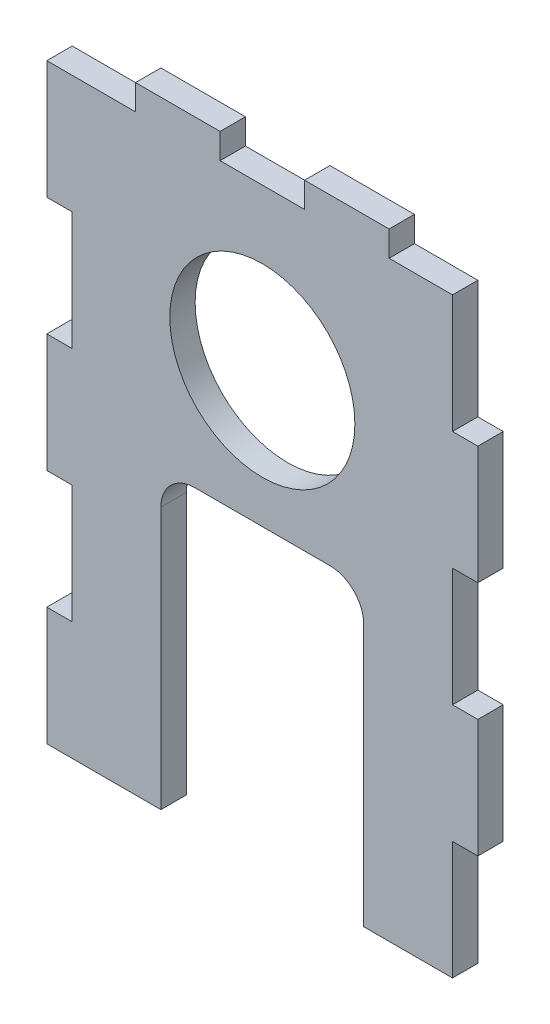
ISO-10303-21;
HEADER;
FILE_DESCRIPTION(('STEP AP214'),'2;1');
FILE_NAME('part.step','',(''),(''),'','','');
FILE_SCHEMA(('AUTOMOTIVE_DESIGN { 1 0 10303 214 1 1 1 1 }'));
ENDSEC;
DATA;
#1=APPLICATION_CONTEXT('core data for automotive mechanical design processes');
#2=APPLICATION_PROTOCOL_DEFINITION('international standard','automotive_design',2000,#1);
#3=PRODUCT_CONTEXT('',#1,'mechanical');
#4=PRODUCT('Part','Part','',(#3));
#5=PRODUCT_RELATED_PRODUCT_CATEGORY('part','',(#4));
#6=PRODUCT_DEFINITION_FORMATION('','',#4);
#7=PRODUCT_DEFINITION_CONTEXT('part definition',#1,'design');
#8=PRODUCT_DEFINITION('design','',#6,#7);
#9=PRODUCT_DEFINITION_SHAPE('','',#8);
#10=(LENGTH_UNIT() NAMED_UNIT(*) SI_UNIT(.MILLI.,.METRE.));
#11=(NAMED_UNIT(*) PLANE_ANGLE_UNIT() SI_UNIT($,.RADIAN.));
#12=(NAMED_UNIT(*) SI_UNIT($,.STERADIAN.) SOLID_ANGLE_UNIT());
#13=UNCERTAINTY_MEASURE_WITH_UNIT(LENGTH_MEASURE(1.E-05),#10,'distance_accuracy_value','');
#14=(GEOMETRIC_REPRESENTATION_CONTEXT(3) GLOBAL_UNCERTAINTY_ASSIGNED_CONTEXT((#13)) GLOBAL_UNIT_ASSIGNED_CONTEXT((#10,
#11,#12)) REPRESENTATION_CONTEXT('',''));
#15=CARTESIAN_POINT('',(0.,0.,0.));
#16=DIRECTION('',(0.,0.,1.));
#17=DIRECTION('',(1.,0.,0.));
#18=AXIS2_PLACEMENT_3D('',#15,#16,#17);
#19=CARTESIAN_POINT('',(22.5,-35.,3.));
#20=DIRECTION('',(-1.,0.,0.));
#21=DIRECTION('',(0.,0.,1.));
#22=AXIS2_PLACEMENT_3D('',#19,#20,#21);
#23=PLANE('',#22);
#24=DIRECTION('',(0.,1.,0.));
#25=VECTOR('',#24,1.);
#26=CARTESIAN_POINT('',(22.5,-35.,3.));
#27=LINE('',#26,#25);
#28=CARTESIAN_POINT('',(22.5,21.,3.));
#29=VERTEX_POINT('',#28);
#30=CARTESIAN_POINT('',(22.5,35.,3.));
#31=VERTEX_POINT('',#30);
#32=EDGE_CURVE('E36',#29,#31,#27,.T.);
#33=ORIENTED_EDGE('',*,*,#32,.F.);
#34=DIRECTION('',(0.,0.,-1.));
#35=VECTOR('',#34,1.);
#36=CARTESIAN_POINT('',(22.5,21.,17.3178210632764));
#37=LINE('',#36,#35);
#38=CARTESIAN_POINT('',(22.5,21.,0.));
#39=VERTEX_POINT('',#38);
#40=EDGE_CURVE('E279',#29,#39,#37,.T.);
#41=ORIENTED_EDGE('',*,*,#40,.T.);
#42=DIRECTION('',(0.,1.,0.));
#43=VECTOR('',#42,1.);
#44=CARTESIAN_POINT('',(22.5,-35.,0.));
#45=LINE('',#44,#43);
#46=CARTESIAN_POINT('',(22.5,35.,0.));
#47=VERTEX_POINT('',#46);
#48=EDGE_CURVE('E372',#39,#47,#45,.T.);
#49=ORIENTED_EDGE('',*,*,#48,.T.);
#50=DIRECTION('',(0.,0.,-1.));
#51=VECTOR('',#50,1.);
#52=CARTESIAN_POINT('',(22.5,35.,3.));
#53=LINE('',#52,#51);
#54=EDGE_CURVE('E351',#31,#47,#53,.T.);
#55=ORIENTED_EDGE('',*,*,#54,.F.);
#56=EDGE_LOOP('',(#33,#41,#49,#55));
#57=FACE_BOUND('',#56,.T.);
#58=ADVANCED_FACE('F32',(#57),#23,.F.);
#59=DIRECTION('',(0.,0.,-1.));
#60=VECTOR('',#59,1.);
#61=CARTESIAN_POINT('',(22.5,-21.,17.3178210632764));
#62=LINE('',#61,#60);
#63=CARTESIAN_POINT('',(22.5,-21.,3.));
#64=VERTEX_POINT('',#63);
#65=CARTESIAN_POINT('',(22.5,-21.,0.));
#66=VERTEX_POINT('',#65);
#67=EDGE_CURVE('E324',#64,#66,#62,.T.);
#68=ORIENTED_EDGE('',*,*,#67,.F.);
#69=CARTESIAN_POINT('',(22.5,-35.,3.));
#70=VERTEX_POINT('',#69);
#71=EDGE_CURVE('E404',#70,#64,#27,.T.);
#72=ORIENTED_EDGE('',*,*,#71,.F.);
#73=DIRECTION('',(0.,0.,-1.));
#74=VECTOR('',#73,1.);
#75=CARTESIAN_POINT('',(22.5,-35.,3.));
#76=LINE('',#75,#74);
#77=CARTESIAN_POINT('',(22.5,-35.,0.));
#78=VERTEX_POINT('',#77);
#79=EDGE_CURVE('E517',#70,#78,#76,.T.);
#80=ORIENTED_EDGE('',*,*,#79,.T.);
#81=EDGE_CURVE('E363',#78,#66,#45,.T.);
#82=ORIENTED_EDGE('',*,*,#81,.T.);
#83=EDGE_LOOP('',(#68,#72,#80,#82));
#84=FACE_BOUND('',#83,.T.);
#85=ADVANCED_FACE('F593',(#84),#23,.F.);
#86=CARTESIAN_POINT('',(-22.5,-35.,3.));
#87=DIRECTION('',(-1.,0.,0.));
#88=DIRECTION('',(0.,0.,1.));
#89=AXIS2_PLACEMENT_3D('',#86,#87,#88);
#90=PLANE('',#89);
#91=DIRECTION('',(0.,0.,-1.));
#92=VECTOR('',#91,1.);
#93=CARTESIAN_POINT('',(-22.5,-21.,17.3178210632764));
#94=LINE('',#93,#92);
#95=CARTESIAN_POINT('',(-22.5,-21.,3.));
#96=VERTEX_POINT('',#95);
#97=CARTESIAN_POINT('',(-22.5,-21.,0.));
#98=VERTEX_POINT('',#97);
#99=EDGE_CURVE('E300',#96,#98,#94,.T.);
#100=ORIENTED_EDGE('',*,*,#99,.F.);
#101=DIRECTION('',(0.,1.,0.));
#102=VECTOR('',#101,1.);
#103=CARTESIAN_POINT('',(-22.5,-35.,3.));
#104=LINE('',#103,#102);
#105=CARTESIAN_POINT('',(-22.5,-7.00000000000001,3.));
#106=VERTEX_POINT('',#105);
#107=EDGE_CURVE('E344',#96,#106,#104,.T.);
#108=ORIENTED_EDGE('',*,*,#107,.T.);
#109=DIRECTION('',(0.,0.,-1.));
#110=VECTOR('',#109,1.);
#111=CARTESIAN_POINT('',(-22.5,-7.00000000000001,17.3178210632764));
#112=LINE('',#111,#110);
#113=CARTESIAN_POINT('',(-22.5,-7.00000000000001,0.));
#114=VERTEX_POINT('',#113);
#115=EDGE_CURVE('E529',#106,#114,#112,.T.);
#116=ORIENTED_EDGE('',*,*,#115,.T.);
#117=DIRECTION('',(0.,1.,0.));
#118=VECTOR('',#117,1.);
#119=CARTESIAN_POINT('',(-22.5,-35.,0.));
#120=LINE('',#119,#118);
#121=EDGE_CURVE('E339',#98,#114,#120,.T.);
#122=ORIENTED_EDGE('',*,*,#121,.F.);
#123=EDGE_LOOP('',(#100,#108,#116,#122));
#124=FACE_BOUND('',#123,.T.);
#125=ADVANCED_FACE('F526',(#124),#90,.T.);
#126=DIRECTION('',(0.,0.,-1.));
#127=VECTOR('',#126,1.);
#128=CARTESIAN_POINT('',(-22.5,6.99999999999999,17.3178210632764));
#129=LINE('',#128,#127);
#130=CARTESIAN_POINT('',(-22.5,6.99999999999999,3.));
#131=VERTEX_POINT('',#130);
#132=CARTESIAN_POINT('',(-22.5,6.99999999999999,0.));
#133=VERTEX_POINT('',#132);
#134=EDGE_CURVE('E409',#131,#133,#129,.T.);
#135=ORIENTED_EDGE('',*,*,#134,.F.);
#136=CARTESIAN_POINT('',(-22.5,21.,3.));
#137=VERTEX_POINT('',#136);
#138=EDGE_CURVE('E360',#131,#137,#104,.T.);
#139=ORIENTED_EDGE('',*,*,#138,.T.);
#140=DIRECTION('',(0.,0.,-1.));
#141=VECTOR('',#140,1.);
#142=CARTESIAN_POINT('',(-22.5,21.,17.3178210632764));
#143=LINE('',#142,#141);
#144=CARTESIAN_POINT('',(-22.5,21.,0.));
#145=VERTEX_POINT('',#144);
#146=EDGE_CURVE('E412',#137,#145,#143,.T.);
#147=ORIENTED_EDGE('',*,*,#146,.T.);
#148=EDGE_CURVE('E343',#133,#145,#120,.T.);
#149=ORIENTED_EDGE('',*,*,#148,.F.);
#150=EDGE_LOOP('',(#135,#139,#147,#149));
#151=FACE_BOUND('',#150,.T.);
#152=ADVANCED_FACE('F572',(#151),#90,.T.);
#153=CARTESIAN_POINT('',(-22.5,35.,3.));
#154=DIRECTION('',(0.,1.,0.));
#155=DIRECTION('',(0.,0.,1.));
#156=AXIS2_PLACEMENT_3D('',#153,#154,#155);
#157=PLANE('',#156);
#158=DIRECTION('',(0.,0.,1.));
#159=VECTOR('',#158,1.);
#160=CARTESIAN_POINT('',(5.,35.,-10.4403065089106));
#161=LINE('',#160,#159);
#162=CARTESIAN_POINT('',(5.,35.,0.));
#163=VERTEX_POINT('',#162);
#164=CARTESIAN_POINT('',(5.,35.,3.));
#165=VERTEX_POINT('',#164);
#166=EDGE_CURVE('E426',#163,#165,#161,.T.);
#167=ORIENTED_EDGE('',*,*,#166,.F.);
#168=DIRECTION('',(1.,0.,0.));
#169=VECTOR('',#168,1.);
#170=CARTESIAN_POINT('',(-22.5,35.,0.));
#171=LINE('',#170,#169);
#172=CARTESIAN_POINT('',(-5.00000000000002,35.,0.));
#173=VERTEX_POINT('',#172);
#174=EDGE_CURVE('E388',#173,#163,#171,.T.);
#175=ORIENTED_EDGE('',*,*,#174,.F.);
#176=DIRECTION('',(0.,0.,1.));
#177=VECTOR('',#176,1.);
#178=CARTESIAN_POINT('',(-5.,35.,-10.4403065089106));
#179=LINE('',#178,#177);
#180=CARTESIAN_POINT('',(-5.00000000000002,35.,3.));
#181=VERTEX_POINT('',#180);
#182=EDGE_CURVE('E460',#173,#181,#179,.T.);
#183=ORIENTED_EDGE('',*,*,#182,.T.);
#184=DIRECTION('',(1.,0.,0.));
#185=VECTOR('',#184,1.);
#186=CARTESIAN_POINT('',(-22.5,35.,3.));
#187=LINE('',#186,#185);
#188=EDGE_CURVE('E403',#181,#165,#187,.T.);
#189=ORIENTED_EDGE('',*,*,#188,.T.);
#190=EDGE_LOOP('',(#167,#175,#183,#189));
#191=FACE_BOUND('',#190,.T.);
#192=ADVANCED_FACE('F497',(#191),#157,.T.);
#193=DIRECTION('',(0.,0.,1.));
#194=VECTOR('',#193,1.);
#195=CARTESIAN_POINT('',(15.,35.,-10.4403065089106));
#196=LINE('',#195,#194);
#197=CARTESIAN_POINT('',(15.,35.,0.));
#198=VERTEX_POINT('',#197);
#199=CARTESIAN_POINT('',(15.,35.,3.));
#200=VERTEX_POINT('',#199);
#201=EDGE_CURVE('E437',#198,#200,#196,.T.);
#202=ORIENTED_EDGE('',*,*,#201,.T.);
#203=EDGE_CURVE('E400',#200,#31,#187,.T.);
#204=ORIENTED_EDGE('',*,*,#203,.T.);
#205=ORIENTED_EDGE('',*,*,#54,.T.);
#206=EDGE_CURVE('E383',#198,#47,#171,.T.);
#207=ORIENTED_EDGE('',*,*,#206,.F.);
#208=EDGE_LOOP('',(#202,#204,#205,#207));
#209=FACE_BOUND('',#208,.T.);
#210=ADVANCED_FACE('F607',(#209),#157,.T.);
#211=CARTESIAN_POINT('',(-22.5,-35.,3.));
#212=DIRECTION('',(0.,1.,0.));
#213=DIRECTION('',(0.,0.,1.));
#214=AXIS2_PLACEMENT_3D('',#211,#212,#213);
#215=PLANE('',#214);
#216=DIRECTION('',(1.,0.,0.));
#217=VECTOR('',#216,1.);
#218=CARTESIAN_POINT('',(-22.5,-35.,3.));
#219=LINE('',#218,#217);
#220=CARTESIAN_POINT('',(12.,-35.,3.));
#221=VERTEX_POINT('',#220);
#222=EDGE_CURVE('E342',#221,#70,#219,.T.);
#223=ORIENTED_EDGE('',*,*,#222,.F.);
#224=DIRECTION('',(0.,0.,1.));
#225=VECTOR('',#224,1.);
#226=CARTESIAN_POINT('',(12.,-35.,0.));
#227=LINE('',#226,#225);
#228=CARTESIAN_POINT('',(12.,-35.,0.));
#229=VERTEX_POINT('',#228);
#230=EDGE_CURVE('E649',#229,#221,#227,.T.);
#231=ORIENTED_EDGE('',*,*,#230,.F.);
#232=DIRECTION('',(1.,0.,0.));
#233=VECTOR('',#232,1.);
#234=CARTESIAN_POINT('',(-22.5,-35.,0.));
#235=LINE('',#234,#233);
#236=EDGE_CURVE('E373',#229,#78,#235,.T.);
#237=ORIENTED_EDGE('',*,*,#236,.T.);
#238=ORIENTED_EDGE('',*,*,#79,.F.);
#239=EDGE_LOOP('',(#223,#231,#237,#238));
#240=FACE_BOUND('',#239,.T.);
#241=ADVANCED_FACE('F608',(#240),#215,.F.);
#242=CARTESIAN_POINT('',(-25.5,-35.,0.));
#243=VERTEX_POINT('',#242);
#244=CARTESIAN_POINT('',(-12.,-35.,0.));
#245=VERTEX_POINT('',#244);
#246=EDGE_CURVE('E369',#243,#245,#235,.T.);
#247=ORIENTED_EDGE('',*,*,#246,.T.);
#248=DIRECTION('',(0.,0.,1.));
#249=VECTOR('',#248,1.);
#250=CARTESIAN_POINT('',(-12.,-35.,0.));
#251=LINE('',#250,#249);
#252=CARTESIAN_POINT('',(-12.,-35.,3.));
#253=VERTEX_POINT('',#252);
#254=EDGE_CURVE('E640',#245,#253,#251,.T.);
#255=ORIENTED_EDGE('',*,*,#254,.T.);
#256=CARTESIAN_POINT('',(-25.5,-35.,3.));
#257=VERTEX_POINT('',#256);
#258=EDGE_CURVE('E659',#257,#253,#219,.T.);
#259=ORIENTED_EDGE('',*,*,#258,.F.);
#260=DIRECTION('',(0.,0.,-1.));
#261=VECTOR('',#260,1.);
#262=CARTESIAN_POINT('',(-25.5,-35.,17.3178210632764));
#263=LINE('',#262,#261);
#264=EDGE_CURVE('E296',#257,#243,#263,.T.);
#265=ORIENTED_EDGE('',*,*,#264,.T.);
#266=EDGE_LOOP('',(#247,#255,#259,#265));
#267=FACE_BOUND('',#266,.T.);
#268=ADVANCED_FACE('F602',(#267),#215,.F.);
#269=CARTESIAN_POINT('',(22.5,-7.00000000000001,0.));
#270=VERTEX_POINT('',#269);
#271=CARTESIAN_POINT('',(22.5,6.99999999999999,0.));
#272=VERTEX_POINT('',#271);
#273=EDGE_CURVE('E377',#270,#272,#45,.T.);
#274=ORIENTED_EDGE('',*,*,#273,.T.);
#275=DIRECTION('',(0.,0.,-1.));
#276=VECTOR('',#275,1.);
#277=CARTESIAN_POINT('',(22.5,6.99999999999999,17.3178210632764));
#278=LINE('',#277,#276);
#279=CARTESIAN_POINT('',(22.5,6.99999999999999,3.));
#280=VERTEX_POINT('',#279);
#281=EDGE_CURVE('E57',#280,#272,#278,.T.);
#282=ORIENTED_EDGE('',*,*,#281,.F.);
#283=CARTESIAN_POINT('',(22.5,-7.00000000000001,3.));
#284=VERTEX_POINT('',#283);
#285=EDGE_CURVE('E665',#284,#280,#27,.T.);
#286=ORIENTED_EDGE('',*,*,#285,.F.);
#287=DIRECTION('',(0.,0.,-1.));
#288=VECTOR('',#287,1.);
#289=CARTESIAN_POINT('',(22.5,-7.00000000000001,17.3178210632764));
#290=LINE('',#289,#288);
#291=EDGE_CURVE('E327',#284,#270,#290,.T.);
#292=ORIENTED_EDGE('',*,*,#291,.T.);
#293=EDGE_LOOP('',(#274,#282,#286,#292));
#294=FACE_BOUND('',#293,.T.);
#295=ADVANCED_FACE('F595',(#294),#23,.F.);
#296=DIRECTION('',(0.,0.,1.));
#297=VECTOR('',#296,1.);
#298=CARTESIAN_POINT('',(-15.,35.,-10.4403065089106));
#299=LINE('',#298,#297);
#300=CARTESIAN_POINT('',(-15.,35.,0.));
#301=VERTEX_POINT('',#300);
#302=CARTESIAN_POINT('',(-15.,35.,3.));
#303=VERTEX_POINT('',#302);
#304=EDGE_CURVE('E454',#301,#303,#299,.T.);
#305=ORIENTED_EDGE('',*,*,#304,.F.);
#306=CARTESIAN_POINT('',(-25.5,35.,0.));
#307=VERTEX_POINT('',#306);
#308=EDGE_CURVE('E357',#307,#301,#171,.T.);
#309=ORIENTED_EDGE('',*,*,#308,.F.);
#310=DIRECTION('',(0.,0.,-1.));
#311=VECTOR('',#310,1.);
#312=CARTESIAN_POINT('',(-25.5,35.,17.3178210632764));
#313=LINE('',#312,#311);
#314=CARTESIAN_POINT('',(-25.5,35.,3.));
#315=VERTEX_POINT('',#314);
#316=EDGE_CURVE('E416',#315,#307,#313,.T.);
#317=ORIENTED_EDGE('',*,*,#316,.F.);
#318=EDGE_CURVE('E362',#315,#303,#187,.T.);
#319=ORIENTED_EDGE('',*,*,#318,.T.);
#320=EDGE_LOOP('',(#305,#309,#317,#319));
#321=FACE_BOUND('',#320,.T.);
#322=ADVANCED_FACE('F576',(#321),#157,.T.);
#323=CARTESIAN_POINT('',(0.,0.,3.));
#324=DIRECTION('',(0.,0.,1.));
#325=DIRECTION('',(1.,0.,0.));
#326=AXIS2_PLACEMENT_3D('',#323,#324,#325);
#327=PLANE('',#326);
#328=DIRECTION('',(0.,1.,0.));
#329=VECTOR('',#328,1.);
#330=CARTESIAN_POINT('',(12.,0.,3.));
#331=LINE('',#330,#329);
#332=CARTESIAN_POINT('',(12.,-4.00000000000001,3.));
#333=VERTEX_POINT('',#332);
#334=EDGE_CURVE('E482',#221,#333,#331,.T.);
#335=ORIENTED_EDGE('',*,*,#334,.F.);
#336=ORIENTED_EDGE('',*,*,#222,.T.);
#337=ORIENTED_EDGE('',*,*,#71,.T.);
#338=DIRECTION('',(-1.,0.,0.));
#339=VECTOR('',#338,1.);
#340=CARTESIAN_POINT('',(22.5,-21.,3.));
#341=LINE('',#340,#339);
#342=CARTESIAN_POINT('',(25.5,-21.,3.));
#343=VERTEX_POINT('',#342);
#344=EDGE_CURVE('E328',#343,#64,#341,.T.);
#345=ORIENTED_EDGE('',*,*,#344,.F.);
#346=DIRECTION('',(0.,-1.,0.));
#347=VECTOR('',#346,1.);
#348=CARTESIAN_POINT('',(25.5,-7.00000000000002,3.));
#349=LINE('',#348,#347);
#350=CARTESIAN_POINT('',(25.5,-7.00000000000002,3.));
#351=VERTEX_POINT('',#350);
#352=EDGE_CURVE('E315',#351,#343,#349,.T.);
#353=ORIENTED_EDGE('',*,*,#352,.F.);
#354=DIRECTION('',(1.,0.,0.));
#355=VECTOR('',#354,1.);
#356=CARTESIAN_POINT('',(22.5,-7.00000000000001,3.));
#357=LINE('',#356,#355);
#358=EDGE_CURVE('E336',#284,#351,#357,.T.);
#359=ORIENTED_EDGE('',*,*,#358,.F.);
#360=ORIENTED_EDGE('',*,*,#285,.T.);
#361=DIRECTION('',(-1.,0.,0.));
#362=VECTOR('',#361,1.);
#363=CARTESIAN_POINT('',(22.5,6.99999999999999,3.));
#364=LINE('',#363,#362);
#365=CARTESIAN_POINT('',(25.5,6.99999999999999,3.));
#366=VERTEX_POINT('',#365);
#367=EDGE_CURVE('E264',#366,#280,#364,.T.);
#368=ORIENTED_EDGE('',*,*,#367,.F.);
#369=DIRECTION('',(0.,-1.,0.));
#370=VECTOR('',#369,1.);
#371=CARTESIAN_POINT('',(25.5,21.,3.));
#372=LINE('',#371,#370);
#373=CARTESIAN_POINT('',(25.5,21.,3.));
#374=VERTEX_POINT('',#373);
#375=EDGE_CURVE('E255',#374,#366,#372,.T.);
#376=ORIENTED_EDGE('',*,*,#375,.F.);
#377=DIRECTION('',(1.,0.,0.));
#378=VECTOR('',#377,1.);
#379=CARTESIAN_POINT('',(22.5,21.,3.));
#380=LINE('',#379,#378);
#381=EDGE_CURVE('E261',#29,#374,#380,.T.);
#382=ORIENTED_EDGE('',*,*,#381,.F.);
#383=ORIENTED_EDGE('',*,*,#32,.T.);
#384=ORIENTED_EDGE('',*,*,#203,.F.);
#385=DIRECTION('',(0.,1.,0.));
#386=VECTOR('',#385,1.);
#387=CARTESIAN_POINT('',(15.,35.,3.));
#388=LINE('',#387,#386);
#389=CARTESIAN_POINT('',(15.,38.,3.));
#390=VERTEX_POINT('',#389);
#391=EDGE_CURVE('E415',#200,#390,#388,.T.);
#392=ORIENTED_EDGE('',*,*,#391,.T.);
#393=DIRECTION('',(-1.,0.,0.));
#394=VECTOR('',#393,1.);
#395=CARTESIAN_POINT('',(15.,38.,3.));
#396=LINE('',#395,#394);
#397=CARTESIAN_POINT('',(5.,38.,3.));
#398=VERTEX_POINT('',#397);
#399=EDGE_CURVE('E431',#390,#398,#396,.T.);
#400=ORIENTED_EDGE('',*,*,#399,.T.);
#401=DIRECTION('',(0.,-1.,0.));
#402=VECTOR('',#401,1.);
#403=CARTESIAN_POINT('',(5.,35.,3.));
#404=LINE('',#403,#402);
#405=EDGE_CURVE('E434',#398,#165,#404,.T.);
#406=ORIENTED_EDGE('',*,*,#405,.T.);
#407=ORIENTED_EDGE('',*,*,#188,.F.);
#408=DIRECTION('',(0.,1.,0.));
#409=VECTOR('',#408,1.);
#410=CARTESIAN_POINT('',(-5.,35.,3.));
#411=LINE('',#410,#409);
#412=CARTESIAN_POINT('',(-5.,38.,3.));
#413=VERTEX_POINT('',#412);
#414=EDGE_CURVE('E455',#181,#413,#411,.T.);
#415=ORIENTED_EDGE('',*,*,#414,.T.);
#416=DIRECTION('',(-1.,0.,0.));
#417=VECTOR('',#416,1.);
#418=CARTESIAN_POINT('',(-15.,38.,3.));
#419=LINE('',#418,#417);
#420=CARTESIAN_POINT('',(-15.,38.,3.));
#421=VERTEX_POINT('',#420);
#422=EDGE_CURVE('E451',#413,#421,#419,.T.);
#423=ORIENTED_EDGE('',*,*,#422,.T.);
#424=DIRECTION('',(0.,-1.,0.));
#425=VECTOR('',#424,1.);
#426=CARTESIAN_POINT('',(-15.,35.,3.));
#427=LINE('',#426,#425);
#428=EDGE_CURVE('E446',#421,#303,#427,.T.);
#429=ORIENTED_EDGE('',*,*,#428,.T.);
#430=ORIENTED_EDGE('',*,*,#318,.F.);
#431=DIRECTION('',(0.,1.,0.));
#432=VECTOR('',#431,1.);
#433=CARTESIAN_POINT('',(-25.5,35.,3.));
#434=LINE('',#433,#432);
#435=CARTESIAN_POINT('',(-25.5,21.,3.));
#436=VERTEX_POINT('',#435);
#437=EDGE_CURVE('E554',#436,#315,#434,.T.);
#438=ORIENTED_EDGE('',*,*,#437,.F.);
#439=DIRECTION('',(-1.,0.,0.));
#440=VECTOR('',#439,1.);
#441=CARTESIAN_POINT('',(-22.5,21.,3.));
#442=LINE('',#441,#440);
#443=EDGE_CURVE('E417',#137,#436,#442,.T.);
#444=ORIENTED_EDGE('',*,*,#443,.F.);
#445=ORIENTED_EDGE('',*,*,#138,.F.);
#446=DIRECTION('',(1.,0.,0.));
#447=VECTOR('',#446,1.);
#448=CARTESIAN_POINT('',(-22.5,6.99999999999999,3.));
#449=LINE('',#448,#447);
#450=CARTESIAN_POINT('',(-25.5,6.99999999999999,3.));
#451=VERTEX_POINT('',#450);
#452=EDGE_CURVE('E551',#451,#131,#449,.T.);
#453=ORIENTED_EDGE('',*,*,#452,.F.);
#454=DIRECTION('',(0.,1.,0.));
#455=VECTOR('',#454,1.);
#456=CARTESIAN_POINT('',(-25.5,6.99999999999999,3.));
#457=LINE('',#456,#455);
#458=CARTESIAN_POINT('',(-25.5,-7.00000000000001,3.));
#459=VERTEX_POINT('',#458);
#460=EDGE_CURVE('E533',#459,#451,#457,.T.);
#461=ORIENTED_EDGE('',*,*,#460,.F.);
#462=DIRECTION('',(-1.,0.,0.));
#463=VECTOR('',#462,1.);
#464=CARTESIAN_POINT('',(-22.5,-7.00000000000001,3.));
#465=LINE('',#464,#463);
#466=EDGE_CURVE('E531',#106,#459,#465,.T.);
#467=ORIENTED_EDGE('',*,*,#466,.F.);
#468=ORIENTED_EDGE('',*,*,#107,.F.);
#469=DIRECTION('',(1.,0.,0.));
#470=VECTOR('',#469,1.);
#471=CARTESIAN_POINT('',(-22.5,-21.,3.));
#472=LINE('',#471,#470);
#473=CARTESIAN_POINT('',(-25.5,-21.,3.));
#474=VERTEX_POINT('',#473);
#475=EDGE_CURVE('E298',#474,#96,#472,.T.);
#476=ORIENTED_EDGE('',*,*,#475,.F.);
#477=DIRECTION('',(0.,1.,0.));
#478=VECTOR('',#477,1.);
#479=CARTESIAN_POINT('',(-25.5,-21.,3.));
#480=LINE('',#479,#478);
#481=EDGE_CURVE('E302',#257,#474,#480,.T.);
#482=ORIENTED_EDGE('',*,*,#481,.F.);
#483=ORIENTED_EDGE('',*,*,#258,.T.);
#484=DIRECTION('',(0.,-1.,0.));
#485=VECTOR('',#484,1.);
#486=CARTESIAN_POINT('',(-12.,0.,3.));
#487=LINE('',#486,#485);
#488=CARTESIAN_POINT('',(-12.,-4.00000000000001,3.));
#489=VERTEX_POINT('',#488);
#490=EDGE_CURVE('E642',#489,#253,#487,.T.);
#491=ORIENTED_EDGE('',*,*,#490,.F.);
#492=CARTESIAN_POINT('',(-8.00000000000001,-4.00000000000001,3.));
#493=DIRECTION('',(0.,0.,1.));
#494=DIRECTION('',(1.,0.,0.));
#495=AXIS2_PLACEMENT_3D('',#492,#493,#494);
#496=CIRCLE('',#495,4.);
#497=CARTESIAN_POINT('',(-8.00000000000001,0.,3.));
#498=VERTEX_POINT('',#497);
#499=EDGE_CURVE('E42',#489,#498,#496,.F.);
#500=ORIENTED_EDGE('',*,*,#499,.T.);
#501=DIRECTION('',(-1.,0.,0.));
#502=VECTOR('',#501,1.);
#503=CARTESIAN_POINT('',(-12.,0.,3.));
#504=LINE('',#503,#502);
#505=CARTESIAN_POINT('',(7.99999999999999,0.,3.));
#506=VERTEX_POINT('',#505);
#507=EDGE_CURVE('E646',#506,#498,#504,.T.);
#508=ORIENTED_EDGE('',*,*,#507,.F.);
#509=CARTESIAN_POINT('',(7.99999999999999,-4.00000000000001,3.));
#510=DIRECTION('',(0.,0.,1.));
#511=DIRECTION('',(1.,0.,0.));
#512=AXIS2_PLACEMENT_3D('',#509,#510,#511);
#513=CIRCLE('',#512,4.);
#514=EDGE_CURVE('E506',#506,#333,#513,.F.);
#515=ORIENTED_EDGE('',*,*,#514,.T.);
#516=EDGE_LOOP('',(#335,#336,#337,#345,#353,#359,#360,#368,#376,#382,#383,#384,#392,#400,#406,
#407,#415,#423,#429,#430,#438,#444,#445,#453,#461,#467,#468,#476,#482,#483,#491,#500,#508,#515));
#517=FACE_BOUND('',#516,.T.);
#518=CARTESIAN_POINT('',(0.,16.,3.));
#519=DIRECTION('',(0.,0.,1.));
#520=DIRECTION('',(1.,0.,0.));
#521=AXIS2_PLACEMENT_3D('',#518,#519,#520);
#522=CIRCLE('',#521,10.95);
#523=CARTESIAN_POINT('',(10.95,16.,3.));
#524=VERTEX_POINT('',#523);
#525=EDGE_CURVE('E651',#524,#524,#522,.T.);
#526=ORIENTED_EDGE('',*,*,#525,.F.);
#527=EDGE_LOOP('',(#526));
#528=FACE_BOUND('',#527,.T.);
#529=ADVANCED_FACE('F258',(#517,#528),#327,.T.);
#530=CARTESIAN_POINT('',(0.,0.,0.));
#531=DIRECTION('',(0.,0.,1.));
#532=DIRECTION('',(1.,0.,0.));
#533=AXIS2_PLACEMENT_3D('',#530,#531,#532);
#534=PLANE('',#533);
#535=ORIENTED_EDGE('',*,*,#236,.F.);
#536=DIRECTION('',(0.,1.,0.));
#537=VECTOR('',#536,1.);
#538=CARTESIAN_POINT('',(12.,0.,0.));
#539=LINE('',#538,#537);
#540=CARTESIAN_POINT('',(12.,-4.00000000000001,0.));
#541=VERTEX_POINT('',#540);
#542=EDGE_CURVE('E634',#229,#541,#539,.T.);
#543=ORIENTED_EDGE('',*,*,#542,.T.);
#544=CARTESIAN_POINT('',(7.99999999999999,-4.00000000000001,0.));
#545=DIRECTION('',(0.,0.,1.));
#546=DIRECTION('',(1.,0.,0.));
#547=AXIS2_PLACEMENT_3D('',#544,#545,#546);
#548=CIRCLE('',#547,4.);
#549=CARTESIAN_POINT('',(7.99999999999999,0.,0.));
#550=VERTEX_POINT('',#549);
#551=EDGE_CURVE('E504',#541,#550,#548,.T.);
#552=ORIENTED_EDGE('',*,*,#551,.T.);
#553=DIRECTION('',(-1.,0.,0.));
#554=VECTOR('',#553,1.);
#555=CARTESIAN_POINT('',(-12.,0.,0.));
#556=LINE('',#555,#554);
#557=CARTESIAN_POINT('',(-8.00000000000001,0.,0.));
#558=VERTEX_POINT('',#557);
#559=EDGE_CURVE('E632',#550,#558,#556,.T.);
#560=ORIENTED_EDGE('',*,*,#559,.T.);
#561=CARTESIAN_POINT('',(-8.00000000000001,-4.00000000000001,0.));
#562=DIRECTION('',(0.,0.,1.));
#563=DIRECTION('',(1.,0.,0.));
#564=AXIS2_PLACEMENT_3D('',#561,#562,#563);
#565=CIRCLE('',#564,4.);
#566=CARTESIAN_POINT('',(-12.,-4.00000000000001,0.));
#567=VERTEX_POINT('',#566);
#568=EDGE_CURVE('E11',#558,#567,#565,.T.);
#569=ORIENTED_EDGE('',*,*,#568,.T.);
#570=DIRECTION('',(0.,-1.,0.));
#571=VECTOR('',#570,1.);
#572=CARTESIAN_POINT('',(-12.,0.,0.));
#573=LINE('',#572,#571);
#574=EDGE_CURVE('E638',#567,#245,#573,.T.);
#575=ORIENTED_EDGE('',*,*,#574,.T.);
#576=ORIENTED_EDGE('',*,*,#246,.F.);
#577=DIRECTION('',(0.,1.,0.));
#578=VECTOR('',#577,1.);
#579=CARTESIAN_POINT('',(-25.5,-21.,0.));
#580=LINE('',#579,#578);
#581=CARTESIAN_POINT('',(-25.5,-21.,0.));
#582=VERTEX_POINT('',#581);
#583=EDGE_CURVE('E293',#243,#582,#580,.T.);
#584=ORIENTED_EDGE('',*,*,#583,.T.);
#585=DIRECTION('',(1.,0.,0.));
#586=VECTOR('',#585,1.);
#587=CARTESIAN_POINT('',(-22.5,-21.,0.));
#588=LINE('',#587,#586);
#589=EDGE_CURVE('E292',#582,#98,#588,.T.);
#590=ORIENTED_EDGE('',*,*,#589,.T.);
#591=ORIENTED_EDGE('',*,*,#121,.T.);
#592=DIRECTION('',(-1.,0.,0.));
#593=VECTOR('',#592,1.);
#594=CARTESIAN_POINT('',(-22.5,-7.00000000000001,0.));
#595=LINE('',#594,#593);
#596=CARTESIAN_POINT('',(-25.5,-7.00000000000001,0.));
#597=VERTEX_POINT('',#596);
#598=EDGE_CURVE('E541',#114,#597,#595,.T.);
#599=ORIENTED_EDGE('',*,*,#598,.T.);
#600=DIRECTION('',(0.,1.,0.));
#601=VECTOR('',#600,1.);
#602=CARTESIAN_POINT('',(-25.5,6.99999999999999,0.));
#603=LINE('',#602,#601);
#604=CARTESIAN_POINT('',(-25.5,6.99999999999999,0.));
#605=VERTEX_POINT('',#604);
#606=EDGE_CURVE('E542',#597,#605,#603,.T.);
#607=ORIENTED_EDGE('',*,*,#606,.T.);
#608=DIRECTION('',(1.,0.,0.));
#609=VECTOR('',#608,1.);
#610=CARTESIAN_POINT('',(-22.5,6.99999999999999,0.));
#611=LINE('',#610,#609);
#612=EDGE_CURVE('E745',#605,#133,#611,.T.);
#613=ORIENTED_EDGE('',*,*,#612,.T.);
#614=ORIENTED_EDGE('',*,*,#148,.T.);
#615=DIRECTION('',(-1.,0.,0.));
#616=VECTOR('',#615,1.);
#617=CARTESIAN_POINT('',(-22.5,21.,0.));
#618=LINE('',#617,#616);
#619=CARTESIAN_POINT('',(-25.5,21.,0.));
#620=VERTEX_POINT('',#619);
#621=EDGE_CURVE('E405',#145,#620,#618,.T.);
#622=ORIENTED_EDGE('',*,*,#621,.T.);
#623=DIRECTION('',(0.,1.,0.));
#624=VECTOR('',#623,1.);
#625=CARTESIAN_POINT('',(-25.5,35.,0.));
#626=LINE('',#625,#624);
#627=EDGE_CURVE('E408',#620,#307,#626,.T.);
#628=ORIENTED_EDGE('',*,*,#627,.T.);
#629=ORIENTED_EDGE('',*,*,#308,.T.);
#630=DIRECTION('',(0.,1.,0.));
#631=VECTOR('',#630,1.);
#632=CARTESIAN_POINT('',(-15.,35.,0.));
#633=LINE('',#632,#631);
#634=CARTESIAN_POINT('',(-15.,38.,0.));
#635=VERTEX_POINT('',#634);
#636=EDGE_CURVE('E449',#301,#635,#633,.T.);
#637=ORIENTED_EDGE('',*,*,#636,.T.);
#638=DIRECTION('',(1.,0.,0.));
#639=VECTOR('',#638,1.);
#640=CARTESIAN_POINT('',(-15.,38.,0.));
#641=LINE('',#640,#639);
#642=CARTESIAN_POINT('',(-5.,38.,0.));
#643=VERTEX_POINT('',#642);
#644=EDGE_CURVE('E447',#635,#643,#641,.T.);
#645=ORIENTED_EDGE('',*,*,#644,.T.);
#646=DIRECTION('',(0.,-1.,0.));
#647=VECTOR('',#646,1.);
#648=CARTESIAN_POINT('',(-5.,35.,0.));
#649=LINE('',#648,#647);
#650=EDGE_CURVE('E450',#643,#173,#649,.T.);
#651=ORIENTED_EDGE('',*,*,#650,.T.);
#652=ORIENTED_EDGE('',*,*,#174,.T.);
#653=DIRECTION('',(0.,1.,0.));
#654=VECTOR('',#653,1.);
#655=CARTESIAN_POINT('',(5.,35.,0.));
#656=LINE('',#655,#654);
#657=CARTESIAN_POINT('',(5.,38.,0.));
#658=VERTEX_POINT('',#657);
#659=EDGE_CURVE('E425',#163,#658,#656,.T.);
#660=ORIENTED_EDGE('',*,*,#659,.T.);
#661=DIRECTION('',(1.,0.,0.));
#662=VECTOR('',#661,1.);
#663=CARTESIAN_POINT('',(15.,38.,0.));
#664=LINE('',#663,#662);
#665=CARTESIAN_POINT('',(15.,38.,0.));
#666=VERTEX_POINT('',#665);
#667=EDGE_CURVE('E423',#658,#666,#664,.T.);
#668=ORIENTED_EDGE('',*,*,#667,.T.);
#669=DIRECTION('',(0.,-1.,0.));
#670=VECTOR('',#669,1.);
#671=CARTESIAN_POINT('',(15.,35.,0.));
#672=LINE('',#671,#670);
#673=EDGE_CURVE('E428',#666,#198,#672,.T.);
#674=ORIENTED_EDGE('',*,*,#673,.T.);
#675=ORIENTED_EDGE('',*,*,#206,.T.);
#676=ORIENTED_EDGE('',*,*,#48,.F.);
#677=DIRECTION('',(1.,0.,0.));
#678=VECTOR('',#677,1.);
#679=CARTESIAN_POINT('',(22.5,21.,0.));
#680=LINE('',#679,#678);
#681=CARTESIAN_POINT('',(25.5,21.,0.));
#682=VERTEX_POINT('',#681);
#683=EDGE_CURVE('E286',#39,#682,#680,.T.);
#684=ORIENTED_EDGE('',*,*,#683,.T.);
#685=DIRECTION('',(0.,-1.,0.));
#686=VECTOR('',#685,1.);
#687=CARTESIAN_POINT('',(25.5,21.,0.));
#688=LINE('',#687,#686);
#689=CARTESIAN_POINT('',(25.5,6.99999999999999,0.));
#690=VERTEX_POINT('',#689);
#691=EDGE_CURVE('E273',#682,#690,#688,.T.);
#692=ORIENTED_EDGE('',*,*,#691,.T.);
#693=DIRECTION('',(-1.,0.,0.));
#694=VECTOR('',#693,1.);
#695=CARTESIAN_POINT('',(22.5,6.99999999999999,0.));
#696=LINE('',#695,#694);
#697=EDGE_CURVE('E280',#690,#272,#696,.T.);
#698=ORIENTED_EDGE('',*,*,#697,.T.);
#699=ORIENTED_EDGE('',*,*,#273,.F.);
#700=DIRECTION('',(1.,0.,0.));
#701=VECTOR('',#700,1.);
#702=CARTESIAN_POINT('',(22.5,-7.00000000000001,0.));
#703=LINE('',#702,#701);
#704=CARTESIAN_POINT('',(25.5,-7.00000000000002,0.));
#705=VERTEX_POINT('',#704);
#706=EDGE_CURVE('E310',#270,#705,#703,.T.);
#707=ORIENTED_EDGE('',*,*,#706,.T.);
#708=DIRECTION('',(0.,-1.,0.));
#709=VECTOR('',#708,1.);
#710=CARTESIAN_POINT('',(25.5,-7.00000000000002,0.));
#711=LINE('',#710,#709);
#712=CARTESIAN_POINT('',(25.5,-21.,0.));
#713=VERTEX_POINT('',#712);
#714=EDGE_CURVE('E311',#705,#713,#711,.T.);
#715=ORIENTED_EDGE('',*,*,#714,.T.);
#716=DIRECTION('',(-1.,0.,0.));
#717=VECTOR('',#716,1.);
#718=CARTESIAN_POINT('',(22.5,-21.,0.));
#719=LINE('',#718,#717);
#720=EDGE_CURVE('E314',#713,#66,#719,.T.);
#721=ORIENTED_EDGE('',*,*,#720,.T.);
#722=ORIENTED_EDGE('',*,*,#81,.F.);
#723=EDGE_LOOP('',(#535,#543,#552,#560,#569,#575,#576,#584,#590,#591,#599,#607,#613,#614,#622,
#628,#629,#637,#645,#651,#652,#660,#668,#674,#675,#676,#684,#692,#698,#699,#707,#715,#721,#722));
#724=FACE_BOUND('',#723,.T.);
#725=CARTESIAN_POINT('',(0.,16.,0.));
#726=DIRECTION('',(0.,0.,1.));
#727=DIRECTION('',(1.,0.,0.));
#728=AXIS2_PLACEMENT_3D('',#725,#726,#727);
#729=CIRCLE('',#728,10.95);
#730=CARTESIAN_POINT('',(10.95,16.,0.));
#731=VERTEX_POINT('',#730);
#732=EDGE_CURVE('E654',#731,#731,#729,.T.);
#733=ORIENTED_EDGE('',*,*,#732,.T.);
#734=EDGE_LOOP('',(#733));
#735=FACE_BOUND('',#734,.T.);
#736=ADVANCED_FACE('F488',(#724,#735),#534,.F.);
#737=CARTESIAN_POINT('',(0.,16.,0.));
#738=DIRECTION('',(0.,0.,1.));
#739=DIRECTION('',(1.,0.,0.));
#740=AXIS2_PLACEMENT_3D('',#737,#738,#739);
#741=CYLINDRICAL_SURFACE('',#740,10.95);
#742=ORIENTED_EDGE('',*,*,#732,.F.);
#743=EDGE_LOOP('',(#742));
#744=FACE_BOUND('',#743,.T.);
#745=ORIENTED_EDGE('',*,*,#525,.T.);
#746=EDGE_LOOP('',(#745));
#747=FACE_BOUND('',#746,.T.);
#748=ADVANCED_FACE('F773',(#744,#747),#741,.F.);
#749=CARTESIAN_POINT('',(12.,0.,0.));
#750=DIRECTION('',(1.,0.,0.));
#751=DIRECTION('',(0.,1.,0.));
#752=AXIS2_PLACEMENT_3D('',#749,#750,#751);
#753=PLANE('',#752);
#754=ORIENTED_EDGE('',*,*,#334,.T.);
#755=DIRECTION('',(0.,0.,1.));
#756=VECTOR('',#755,1.);
#757=CARTESIAN_POINT('',(12.,-4.00000000000001,0.));
#758=LINE('',#757,#756);
#759=EDGE_CURVE('E511',#333,#541,#758,.F.);
#760=ORIENTED_EDGE('',*,*,#759,.T.);
#761=ORIENTED_EDGE('',*,*,#542,.F.);
#762=ORIENTED_EDGE('',*,*,#230,.T.);
#763=EDGE_LOOP('',(#754,#760,#761,#762));
#764=FACE_BOUND('',#763,.T.);
#765=ADVANCED_FACE('F767',(#764),#753,.F.);
#766=CARTESIAN_POINT('',(-12.,0.,0.));
#767=DIRECTION('',(-1.,0.,0.));
#768=DIRECTION('',(0.,-1.,0.));
#769=AXIS2_PLACEMENT_3D('',#766,#767,#768);
#770=PLANE('',#769);
#771=ORIENTED_EDGE('',*,*,#574,.F.);
#772=DIRECTION('',(0.,0.,1.));
#773=VECTOR('',#772,1.);
#774=CARTESIAN_POINT('',(-12.,-4.00000000000001,3.));
#775=LINE('',#774,#773);
#776=EDGE_CURVE('E508',#567,#489,#775,.T.);
#777=ORIENTED_EDGE('',*,*,#776,.T.);
#778=ORIENTED_EDGE('',*,*,#490,.T.);
#779=ORIENTED_EDGE('',*,*,#254,.F.);
#780=EDGE_LOOP('',(#771,#777,#778,#779));
#781=FACE_BOUND('',#780,.T.);
#782=ADVANCED_FACE('F623',(#781),#770,.F.);
#783=CARTESIAN_POINT('',(-12.,0.,0.));
#784=DIRECTION('',(0.,1.,0.));
#785=DIRECTION('',(0.,0.,1.));
#786=AXIS2_PLACEMENT_3D('',#783,#784,#785);
#787=PLANE('',#786);
#788=ORIENTED_EDGE('',*,*,#559,.F.);
#789=DIRECTION('',(0.,0.,1.));
#790=VECTOR('',#789,1.);
#791=CARTESIAN_POINT('',(7.99999999999999,0.,3.));
#792=LINE('',#791,#790);
#793=EDGE_CURVE('E513',#550,#506,#792,.T.);
#794=ORIENTED_EDGE('',*,*,#793,.T.);
#795=ORIENTED_EDGE('',*,*,#507,.T.);
#796=DIRECTION('',(0.,0.,1.));
#797=VECTOR('',#796,1.);
#798=CARTESIAN_POINT('',(-8.00000000000001,0.,0.));
#799=LINE('',#798,#797);
#800=EDGE_CURVE('E516',#498,#558,#799,.F.);
#801=ORIENTED_EDGE('',*,*,#800,.T.);
#802=EDGE_LOOP('',(#788,#794,#795,#801));
#803=FACE_BOUND('',#802,.T.);
#804=ADVANCED_FACE('F616',(#803),#787,.F.);
#805=CARTESIAN_POINT('',(7.99999999999999,-4.00000000000001,0.));
#806=DIRECTION('',(0.,0.,-1.));
#807=DIRECTION('',(-1.,0.,0.));
#808=AXIS2_PLACEMENT_3D('',#805,#806,#807);
#809=CYLINDRICAL_SURFACE('',#808,4.);
#810=ORIENTED_EDGE('',*,*,#551,.F.);
#811=ORIENTED_EDGE('',*,*,#759,.F.);
#812=ORIENTED_EDGE('',*,*,#514,.F.);
#813=ORIENTED_EDGE('',*,*,#793,.F.);
#814=EDGE_LOOP('',(#810,#811,#812,#813));
#815=FACE_BOUND('',#814,.T.);
#816=ADVANCED_FACE('F614',(#815),#809,.F.);
#817=CARTESIAN_POINT('',(-8.00000000000001,-4.00000000000001,0.));
#818=DIRECTION('',(0.,0.,-1.));
#819=DIRECTION('',(-1.,0.,0.));
#820=AXIS2_PLACEMENT_3D('',#817,#818,#819);
#821=CYLINDRICAL_SURFACE('',#820,4.);
#822=ORIENTED_EDGE('',*,*,#568,.F.);
#823=ORIENTED_EDGE('',*,*,#800,.F.);
#824=ORIENTED_EDGE('',*,*,#499,.F.);
#825=ORIENTED_EDGE('',*,*,#776,.F.);
#826=EDGE_LOOP('',(#822,#823,#824,#825));
#827=FACE_BOUND('',#826,.T.);
#828=ADVANCED_FACE('F34',(#827),#821,.F.);
#829=CARTESIAN_POINT('',(-15.,35.,-10.4403065089106));
#830=DIRECTION('',(-1.,0.,0.));
#831=DIRECTION('',(0.,0.,1.));
#832=AXIS2_PLACEMENT_3D('',#829,#830,#831);
#833=PLANE('',#832);
#834=ORIENTED_EDGE('',*,*,#636,.F.);
#835=ORIENTED_EDGE('',*,*,#304,.T.);
#836=ORIENTED_EDGE('',*,*,#428,.F.);
#837=DIRECTION('',(0.,0.,1.));
#838=VECTOR('',#837,1.);
#839=CARTESIAN_POINT('',(-15.,38.,-10.4403065089106));
#840=LINE('',#839,#838);
#841=EDGE_CURVE('E456',#635,#421,#840,.T.);
#842=ORIENTED_EDGE('',*,*,#841,.F.);
#843=EDGE_LOOP('',(#834,#835,#836,#842));
#844=FACE_BOUND('',#843,.T.);
#845=ADVANCED_FACE('F578',(#844),#833,.T.);
#846=CARTESIAN_POINT('',(-15.,38.,-10.4403065089106));
#847=DIRECTION('',(0.,1.,0.));
#848=DIRECTION('',(0.,0.,1.));
#849=AXIS2_PLACEMENT_3D('',#846,#847,#848);
#850=PLANE('',#849);
#851=ORIENTED_EDGE('',*,*,#644,.F.);
#852=ORIENTED_EDGE('',*,*,#841,.T.);
#853=ORIENTED_EDGE('',*,*,#422,.F.);
#854=DIRECTION('',(0.,0.,1.));
#855=VECTOR('',#854,1.);
#856=CARTESIAN_POINT('',(-5.,38.,-10.4403065089106));
#857=LINE('',#856,#855);
#858=EDGE_CURVE('E458',#643,#413,#857,.T.);
#859=ORIENTED_EDGE('',*,*,#858,.F.);
#860=EDGE_LOOP('',(#851,#852,#853,#859));
#861=FACE_BOUND('',#860,.T.);
#862=ADVANCED_FACE('F581',(#861),#850,.T.);
#863=CARTESIAN_POINT('',(-5.,35.,-10.4403065089106));
#864=DIRECTION('',(1.,0.,0.));
#865=DIRECTION('',(0.,1.,0.));
#866=AXIS2_PLACEMENT_3D('',#863,#864,#865);
#867=PLANE('',#866);
#868=ORIENTED_EDGE('',*,*,#650,.F.);
#869=ORIENTED_EDGE('',*,*,#858,.T.);
#870=ORIENTED_EDGE('',*,*,#414,.F.);
#871=ORIENTED_EDGE('',*,*,#182,.F.);
#872=EDGE_LOOP('',(#868,#869,#870,#871));
#873=FACE_BOUND('',#872,.T.);
#874=ADVANCED_FACE('F493',(#873),#867,.T.);
#875=CARTESIAN_POINT('',(5.,35.,-10.4403065089106));
#876=DIRECTION('',(-1.,0.,0.));
#877=DIRECTION('',(0.,-1.,0.));
#878=AXIS2_PLACEMENT_3D('',#875,#876,#877);
#879=PLANE('',#878);
#880=ORIENTED_EDGE('',*,*,#659,.F.);
#881=ORIENTED_EDGE('',*,*,#166,.T.);
#882=ORIENTED_EDGE('',*,*,#405,.F.);
#883=DIRECTION('',(0.,0.,1.));
#884=VECTOR('',#883,1.);
#885=CARTESIAN_POINT('',(5.,38.,-10.4403065089106));
#886=LINE('',#885,#884);
#887=EDGE_CURVE('E439',#658,#398,#886,.T.);
#888=ORIENTED_EDGE('',*,*,#887,.F.);
#889=EDGE_LOOP('',(#880,#881,#882,#888));
#890=FACE_BOUND('',#889,.T.);
#891=ADVANCED_FACE('F588',(#890),#879,.T.);
#892=CARTESIAN_POINT('',(15.,38.,-10.4403065089106));
#893=DIRECTION('',(0.,1.,0.));
#894=DIRECTION('',(0.,0.,1.));
#895=AXIS2_PLACEMENT_3D('',#892,#893,#894);
#896=PLANE('',#895);
#897=ORIENTED_EDGE('',*,*,#667,.F.);
#898=ORIENTED_EDGE('',*,*,#887,.T.);
#899=ORIENTED_EDGE('',*,*,#399,.F.);
#900=DIRECTION('',(0.,0.,1.));
#901=VECTOR('',#900,1.);
#902=CARTESIAN_POINT('',(15.,38.,-10.4403065089106));
#903=LINE('',#902,#901);
#904=EDGE_CURVE('E441',#666,#390,#903,.T.);
#905=ORIENTED_EDGE('',*,*,#904,.F.);
#906=EDGE_LOOP('',(#897,#898,#899,#905));
#907=FACE_BOUND('',#906,.T.);
#908=ADVANCED_FACE('F677',(#907),#896,.T.);
#909=CARTESIAN_POINT('',(15.,35.,-10.4403065089106));
#910=DIRECTION('',(1.,0.,0.));
#911=DIRECTION('',(0.,0.,-1.));
#912=AXIS2_PLACEMENT_3D('',#909,#910,#911);
#913=PLANE('',#912);
#914=ORIENTED_EDGE('',*,*,#673,.F.);
#915=ORIENTED_EDGE('',*,*,#904,.T.);
#916=ORIENTED_EDGE('',*,*,#391,.F.);
#917=ORIENTED_EDGE('',*,*,#201,.F.);
#918=EDGE_LOOP('',(#914,#915,#916,#917));
#919=FACE_BOUND('',#918,.T.);
#920=ADVANCED_FACE('F671',(#919),#913,.T.);
#921=CARTESIAN_POINT('',(-22.5,21.,17.3178210632764));
#922=DIRECTION('',(0.,-1.,0.));
#923=DIRECTION('',(0.,0.,-1.));
#924=AXIS2_PLACEMENT_3D('',#921,#922,#923);
#925=PLANE('',#924);
#926=ORIENTED_EDGE('',*,*,#146,.F.);
#927=ORIENTED_EDGE('',*,*,#443,.T.);
#928=DIRECTION('',(0.,0.,-1.));
#929=VECTOR('',#928,1.);
#930=CARTESIAN_POINT('',(-25.5,21.,17.3178210632764));
#931=LINE('',#930,#929);
#932=EDGE_CURVE('E421',#436,#620,#931,.T.);
#933=ORIENTED_EDGE('',*,*,#932,.T.);
#934=ORIENTED_EDGE('',*,*,#621,.F.);
#935=EDGE_LOOP('',(#926,#927,#933,#934));
#936=FACE_BOUND('',#935,.T.);
#937=ADVANCED_FACE('F568',(#936),#925,.T.);
#938=CARTESIAN_POINT('',(-25.5,35.,17.3178210632764));
#939=DIRECTION('',(-1.,0.,0.));
#940=DIRECTION('',(0.,-1.,0.));
#941=AXIS2_PLACEMENT_3D('',#938,#939,#940);
#942=PLANE('',#941);
#943=ORIENTED_EDGE('',*,*,#932,.F.);
#944=ORIENTED_EDGE('',*,*,#437,.T.);
#945=ORIENTED_EDGE('',*,*,#316,.T.);
#946=ORIENTED_EDGE('',*,*,#627,.F.);
#947=EDGE_LOOP('',(#943,#944,#945,#946));
#948=FACE_BOUND('',#947,.T.);
#949=ADVANCED_FACE('F561',(#948),#942,.T.);
#950=CARTESIAN_POINT('',(-22.5,-7.00000000000001,17.3178210632764));
#951=DIRECTION('',(0.,-1.,0.));
#952=DIRECTION('',(0.,0.,-1.));
#953=AXIS2_PLACEMENT_3D('',#950,#951,#952);
#954=PLANE('',#953);
#955=ORIENTED_EDGE('',*,*,#115,.F.);
#956=ORIENTED_EDGE('',*,*,#466,.T.);
#957=DIRECTION('',(0.,0.,-1.));
#958=VECTOR('',#957,1.);
#959=CARTESIAN_POINT('',(-25.5,-7.00000000000001,17.3178210632764));
#960=LINE('',#959,#958);
#961=EDGE_CURVE('E536',#459,#597,#960,.T.);
#962=ORIENTED_EDGE('',*,*,#961,.T.);
#963=ORIENTED_EDGE('',*,*,#598,.F.);
#964=EDGE_LOOP('',(#955,#956,#962,#963));
#965=FACE_BOUND('',#964,.T.);
#966=ADVANCED_FACE('F539',(#965),#954,.T.);
#967=CARTESIAN_POINT('',(-25.5,6.99999999999999,17.3178210632764));
#968=DIRECTION('',(-1.,0.,0.));
#969=DIRECTION('',(0.,-1.,0.));
#970=AXIS2_PLACEMENT_3D('',#967,#968,#969);
#971=PLANE('',#970);
#972=ORIENTED_EDGE('',*,*,#961,.F.);
#973=ORIENTED_EDGE('',*,*,#460,.T.);
#974=DIRECTION('',(0.,0.,-1.));
#975=VECTOR('',#974,1.);
#976=CARTESIAN_POINT('',(-25.5,6.99999999999999,17.3178210632764));
#977=LINE('',#976,#975);
#978=EDGE_CURVE('E751',#451,#605,#977,.T.);
#979=ORIENTED_EDGE('',*,*,#978,.T.);
#980=ORIENTED_EDGE('',*,*,#606,.F.);
#981=EDGE_LOOP('',(#972,#973,#979,#980));
#982=FACE_BOUND('',#981,.T.);
#983=ADVANCED_FACE('F697',(#982),#971,.T.);
#984=CARTESIAN_POINT('',(-22.5,6.99999999999999,17.3178210632764));
#985=DIRECTION('',(0.,1.,0.));
#986=DIRECTION('',(0.,0.,1.));
#987=AXIS2_PLACEMENT_3D('',#984,#985,#986);
#988=PLANE('',#987);
#989=ORIENTED_EDGE('',*,*,#978,.F.);
#990=ORIENTED_EDGE('',*,*,#452,.T.);
#991=ORIENTED_EDGE('',*,*,#134,.T.);
#992=ORIENTED_EDGE('',*,*,#612,.F.);
#993=EDGE_LOOP('',(#989,#990,#991,#992));
#994=FACE_BOUND('',#993,.T.);
#995=ADVANCED_FACE('F702',(#994),#988,.T.);
#996=CARTESIAN_POINT('',(22.5,-7.00000000000001,17.3178210632764));
#997=DIRECTION('',(0.,1.,0.));
#998=DIRECTION('',(-1.,0.,0.));
#999=AXIS2_PLACEMENT_3D('',#996,#997,#998);
#1000=PLANE('',#999);
#1001=ORIENTED_EDGE('',*,*,#291,.F.);
#1002=ORIENTED_EDGE('',*,*,#358,.T.);
#1003=DIRECTION('',(0.,0.,-1.));
#1004=VECTOR('',#1003,1.);
#1005=CARTESIAN_POINT('',(25.5,-7.00000000000002,17.3178210632764));
#1006=LINE('',#1005,#1004);
#1007=EDGE_CURVE('E319',#351,#705,#1006,.T.);
#1008=ORIENTED_EDGE('',*,*,#1007,.T.);
#1009=ORIENTED_EDGE('',*,*,#706,.F.);
#1010=EDGE_LOOP('',(#1001,#1002,#1008,#1009));
#1011=FACE_BOUND('',#1010,.T.);
#1012=ADVANCED_FACE('F706',(#1011),#1000,.T.);
#1013=CARTESIAN_POINT('',(25.5,-7.00000000000002,17.3178210632764));
#1014=DIRECTION('',(1.,0.,0.));
#1015=DIRECTION('',(0.,0.,-1.));
#1016=AXIS2_PLACEMENT_3D('',#1013,#1014,#1015);
#1017=PLANE('',#1016);
#1018=ORIENTED_EDGE('',*,*,#1007,.F.);
#1019=ORIENTED_EDGE('',*,*,#352,.T.);
#1020=DIRECTION('',(0.,0.,-1.));
#1021=VECTOR('',#1020,1.);
#1022=CARTESIAN_POINT('',(25.5,-21.,17.3178210632764));
#1023=LINE('',#1022,#1021);
#1024=EDGE_CURVE('E318',#343,#713,#1023,.T.);
#1025=ORIENTED_EDGE('',*,*,#1024,.T.);
#1026=ORIENTED_EDGE('',*,*,#714,.F.);
#1027=EDGE_LOOP('',(#1018,#1019,#1025,#1026));
#1028=FACE_BOUND('',#1027,.T.);
#1029=ADVANCED_FACE('F710',(#1028),#1017,.T.);
#1030=CARTESIAN_POINT('',(22.5,-21.,17.3178210632764));
#1031=DIRECTION('',(0.,-1.,0.));
#1032=DIRECTION('',(1.,0.,0.));
#1033=AXIS2_PLACEMENT_3D('',#1030,#1031,#1032);
#1034=PLANE('',#1033);
#1035=ORIENTED_EDGE('',*,*,#1024,.F.);
#1036=ORIENTED_EDGE('',*,*,#344,.T.);
#1037=ORIENTED_EDGE('',*,*,#67,.T.);
#1038=ORIENTED_EDGE('',*,*,#720,.F.);
#1039=EDGE_LOOP('',(#1035,#1036,#1037,#1038));
#1040=FACE_BOUND('',#1039,.T.);
#1041=ADVANCED_FACE('F714',(#1040),#1034,.T.);
#1042=CARTESIAN_POINT('',(-25.5,-21.,17.3178210632764));
#1043=DIRECTION('',(-1.,0.,0.));
#1044=DIRECTION('',(0.,-1.,0.));
#1045=AXIS2_PLACEMENT_3D('',#1042,#1043,#1044);
#1046=PLANE('',#1045);
#1047=ORIENTED_EDGE('',*,*,#264,.F.);
#1048=ORIENTED_EDGE('',*,*,#481,.T.);
#1049=DIRECTION('',(0.,0.,-1.));
#1050=VECTOR('',#1049,1.);
#1051=CARTESIAN_POINT('',(-25.5,-21.,17.3178210632764));
#1052=LINE('',#1051,#1050);
#1053=EDGE_CURVE('E301',#474,#582,#1052,.T.);
#1054=ORIENTED_EDGE('',*,*,#1053,.T.);
#1055=ORIENTED_EDGE('',*,*,#583,.F.);
#1056=EDGE_LOOP('',(#1047,#1048,#1054,#1055));
#1057=FACE_BOUND('',#1056,.T.);
#1058=ADVANCED_FACE('F718',(#1057),#1046,.T.);
#1059=CARTESIAN_POINT('',(-22.5,-21.,17.3178210632764));
#1060=DIRECTION('',(0.,1.,0.));
#1061=DIRECTION('',(0.,0.,1.));
#1062=AXIS2_PLACEMENT_3D('',#1059,#1060,#1061);
#1063=PLANE('',#1062);
#1064=ORIENTED_EDGE('',*,*,#1053,.F.);
#1065=ORIENTED_EDGE('',*,*,#475,.T.);
#1066=ORIENTED_EDGE('',*,*,#99,.T.);
#1067=ORIENTED_EDGE('',*,*,#589,.F.);
#1068=EDGE_LOOP('',(#1064,#1065,#1066,#1067));
#1069=FACE_BOUND('',#1068,.T.);
#1070=ADVANCED_FACE('F722',(#1069),#1063,.T.);
#1071=CARTESIAN_POINT('',(22.5,21.,17.3178210632764));
#1072=DIRECTION('',(0.,1.,0.));
#1073=DIRECTION('',(0.,0.,1.));
#1074=AXIS2_PLACEMENT_3D('',#1071,#1072,#1073);
#1075=PLANE('',#1074);
#1076=ORIENTED_EDGE('',*,*,#40,.F.);
#1077=ORIENTED_EDGE('',*,*,#381,.T.);
#1078=DIRECTION('',(0.,0.,-1.));
#1079=VECTOR('',#1078,1.);
#1080=CARTESIAN_POINT('',(25.5,21.,17.3178210632764));
#1081=LINE('',#1080,#1079);
#1082=EDGE_CURVE('E268',#374,#682,#1081,.T.);
#1083=ORIENTED_EDGE('',*,*,#1082,.T.);
#1084=ORIENTED_EDGE('',*,*,#683,.F.);
#1085=EDGE_LOOP('',(#1076,#1077,#1083,#1084));
#1086=FACE_BOUND('',#1085,.T.);
#1087=ADVANCED_FACE('F278',(#1086),#1075,.T.);
#1088=CARTESIAN_POINT('',(25.5,21.,17.3178210632764));
#1089=DIRECTION('',(1.,0.,0.));
#1090=DIRECTION('',(0.,1.,0.));
#1091=AXIS2_PLACEMENT_3D('',#1088,#1089,#1090);
#1092=PLANE('',#1091);
#1093=ORIENTED_EDGE('',*,*,#1082,.F.);
#1094=ORIENTED_EDGE('',*,*,#375,.T.);
#1095=DIRECTION('',(0.,0.,-1.));
#1096=VECTOR('',#1095,1.);
#1097=CARTESIAN_POINT('',(25.5,6.99999999999999,17.3178210632764));
#1098=LINE('',#1097,#1096);
#1099=EDGE_CURVE('E267',#366,#690,#1098,.T.);
#1100=ORIENTED_EDGE('',*,*,#1099,.T.);
#1101=ORIENTED_EDGE('',*,*,#691,.F.);
#1102=EDGE_LOOP('',(#1093,#1094,#1100,#1101));
#1103=FACE_BOUND('',#1102,.T.);
#1104=ADVANCED_FACE('F271',(#1103),#1092,.T.);
#1105=CARTESIAN_POINT('',(22.5,6.99999999999999,17.3178210632764));
#1106=DIRECTION('',(0.,-1.,0.));
#1107=DIRECTION('',(1.,0.,0.));
#1108=AXIS2_PLACEMENT_3D('',#1105,#1106,#1107);
#1109=PLANE('',#1108);
#1110=ORIENTED_EDGE('',*,*,#1099,.F.);
#1111=ORIENTED_EDGE('',*,*,#367,.T.);
#1112=ORIENTED_EDGE('',*,*,#281,.T.);
#1113=ORIENTED_EDGE('',*,*,#697,.F.);
#1114=EDGE_LOOP('',(#1110,#1111,#1112,#1113));
#1115=FACE_BOUND('',#1114,.T.);
#1116=ADVANCED_FACE('F731',(#1115),#1109,.T.);
#1117=CLOSED_SHELL('',(#58,#85,#125,#152,#192,#210,#241,#268,#295,#322,#529,#736,#748,#765,#782,
#804,#816,#828,#845,#862,#874,#891,#908,#920,#937,#949,#966,#983,#995,#1012,#1029,#1041,#1058,
#1070,#1087,#1104,#1116));
#1118=MANIFOLD_SOLID_BREP('B2',#1117);
#1119=ADVANCED_BREP_SHAPE_REPRESENTATION('',(#18,#1118),#14);
#1120=SHAPE_DEFINITION_REPRESENTATION(#9,#1119);
ENDSEC;
END-ISO-10303-21;
